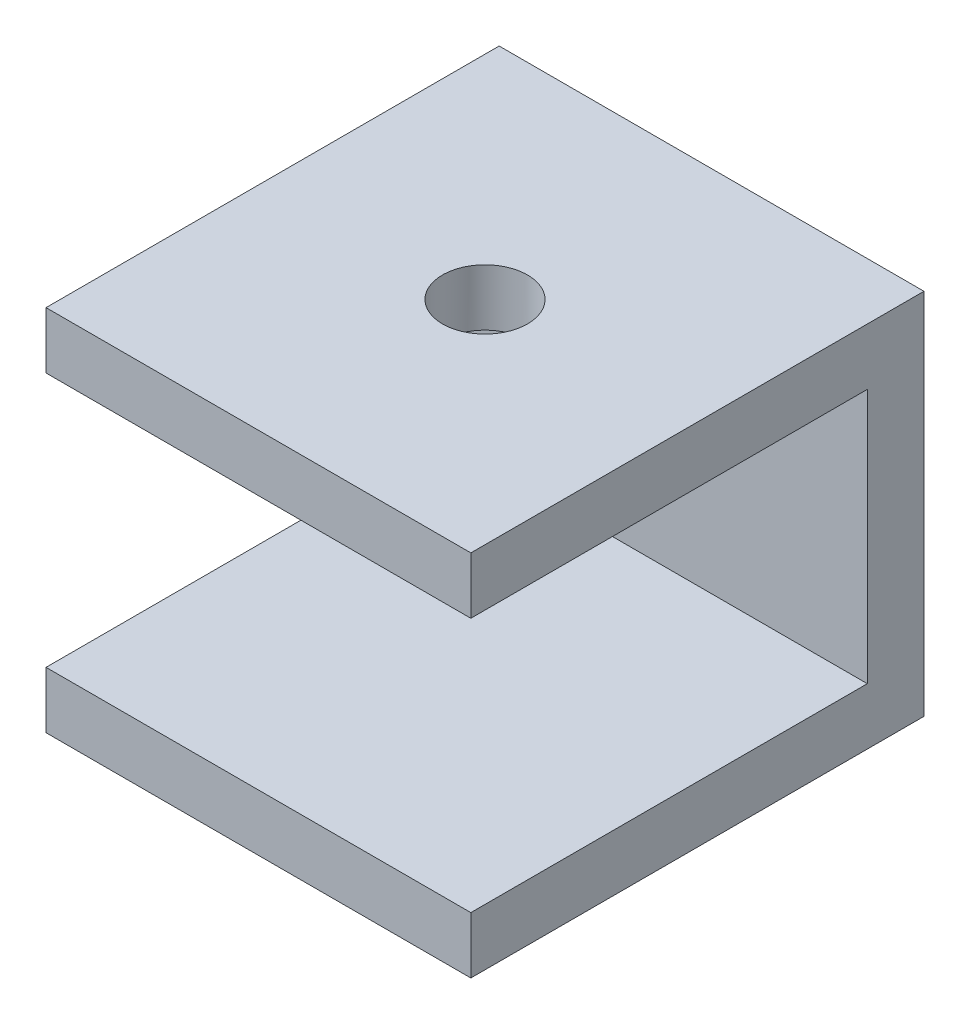
ISO-10303-21;
HEADER;
FILE_DESCRIPTION(('STEP AP214'),'2;1');
FILE_NAME('part.step','',(''),(''),'','','');
FILE_SCHEMA(('AUTOMOTIVE_DESIGN { 1 0 10303 214 1 1 1 1 }'));
ENDSEC;
DATA;
#1=APPLICATION_CONTEXT('core data for automotive mechanical design processes');
#2=APPLICATION_PROTOCOL_DEFINITION('international standard','automotive_design',2000,#1);
#3=PRODUCT_CONTEXT('',#1,'mechanical');
#4=PRODUCT('Part','Part','',(#3));
#5=PRODUCT_RELATED_PRODUCT_CATEGORY('part','',(#4));
#6=PRODUCT_DEFINITION_FORMATION('','',#4);
#7=PRODUCT_DEFINITION_CONTEXT('part definition',#1,'design');
#8=PRODUCT_DEFINITION('design','',#6,#7);
#9=PRODUCT_DEFINITION_SHAPE('','',#8);
#10=(LENGTH_UNIT() NAMED_UNIT(*) SI_UNIT(.MILLI.,.METRE.));
#11=(NAMED_UNIT(*) PLANE_ANGLE_UNIT() SI_UNIT($,.RADIAN.));
#12=(NAMED_UNIT(*) SI_UNIT($,.STERADIAN.) SOLID_ANGLE_UNIT());
#13=UNCERTAINTY_MEASURE_WITH_UNIT(LENGTH_MEASURE(1.E-05),#10,'distance_accuracy_value','');
#14=(GEOMETRIC_REPRESENTATION_CONTEXT(3) GLOBAL_UNCERTAINTY_ASSIGNED_CONTEXT((#13)) GLOBAL_UNIT_ASSIGNED_CONTEXT((#10,
#11,#12)) REPRESENTATION_CONTEXT('',''));
#15=CARTESIAN_POINT('',(0.,0.,0.));
#16=DIRECTION('',(0.,0.,1.));
#17=DIRECTION('',(1.,0.,0.));
#18=AXIS2_PLACEMENT_3D('',#15,#16,#17);
#19=CARTESIAN_POINT('',(-15.,0.,16.));
#20=DIRECTION('',(0.,1.,0.));
#21=DIRECTION('',(0.,0.,1.));
#22=AXIS2_PLACEMENT_3D('',#19,#20,#21);
#23=PLANE('',#22);
#24=CARTESIAN_POINT('',(-7.5,0.,8.));
#25=DIRECTION('',(0.,1.,0.));
#26=DIRECTION('',(0.,0.,1.));
#27=AXIS2_PLACEMENT_3D('',#24,#25,#26);
#28=CIRCLE('',#27,1.5);
#29=CARTESIAN_POINT('',(-7.5,0.,9.5));
#30=VERTEX_POINT('',#29);
#31=EDGE_CURVE('E133',#30,#30,#28,.T.);
#32=ORIENTED_EDGE('',*,*,#31,.F.);
#33=EDGE_LOOP('',(#32));
#34=FACE_BOUND('',#33,.T.);
#35=DIRECTION('',(0.,0.,1.));
#36=VECTOR('',#35,1.);
#37=CARTESIAN_POINT('',(0.,0.,16.));
#38=LINE('',#37,#36);
#39=CARTESIAN_POINT('',(0.,0.,0.));
#40=VERTEX_POINT('',#39);
#41=CARTESIAN_POINT('',(0.,0.,16.));
#42=VERTEX_POINT('',#41);
#43=EDGE_CURVE('E129',#40,#42,#38,.T.);
#44=ORIENTED_EDGE('',*,*,#43,.F.);
#45=DIRECTION('',(1.,0.,0.));
#46=VECTOR('',#45,1.);
#47=CARTESIAN_POINT('',(-15.,0.,0.));
#48=LINE('',#47,#46);
#49=CARTESIAN_POINT('',(-15.,0.,0.));
#50=VERTEX_POINT('',#49);
#51=EDGE_CURVE('E11',#50,#40,#48,.T.);
#52=ORIENTED_EDGE('',*,*,#51,.F.);
#53=DIRECTION('',(0.,0.,1.));
#54=VECTOR('',#53,1.);
#55=CARTESIAN_POINT('',(-15.,0.,16.));
#56=LINE('',#55,#54);
#57=CARTESIAN_POINT('',(-15.,0.,16.));
#58=VERTEX_POINT('',#57);
#59=EDGE_CURVE('E150',#50,#58,#56,.T.);
#60=ORIENTED_EDGE('',*,*,#59,.T.);
#61=DIRECTION('',(1.,0.,0.));
#62=VECTOR('',#61,1.);
#63=CARTESIAN_POINT('',(-15.,0.,16.));
#64=LINE('',#63,#62);
#65=EDGE_CURVE('E35',#58,#42,#64,.T.);
#66=ORIENTED_EDGE('',*,*,#65,.T.);
#67=EDGE_LOOP('',(#44,#52,#60,#66));
#68=FACE_BOUND('',#67,.T.);
#69=ADVANCED_FACE('F32',(#34,#68),#23,.T.);
#70=CARTESIAN_POINT('',(-15.,0.,0.));
#71=DIRECTION('',(0.,0.,-1.));
#72=DIRECTION('',(0.,1.,0.));
#73=AXIS2_PLACEMENT_3D('',#70,#71,#72);
#74=PLANE('',#73);
#75=DIRECTION('',(0.,1.,0.));
#76=VECTOR('',#75,1.);
#77=CARTESIAN_POINT('',(0.,0.,0.));
#78=LINE('',#77,#76);
#79=CARTESIAN_POINT('',(0.,-13.,0.));
#80=VERTEX_POINT('',#79);
#81=EDGE_CURVE('E148',#80,#40,#78,.T.);
#82=ORIENTED_EDGE('',*,*,#81,.F.);
#83=DIRECTION('',(1.,0.,0.));
#84=VECTOR('',#83,1.);
#85=CARTESIAN_POINT('',(-15.,-13.,0.));
#86=LINE('',#85,#84);
#87=CARTESIAN_POINT('',(-15.,-13.,0.));
#88=VERTEX_POINT('',#87);
#89=EDGE_CURVE('E41',#88,#80,#86,.T.);
#90=ORIENTED_EDGE('',*,*,#89,.F.);
#91=DIRECTION('',(0.,1.,0.));
#92=VECTOR('',#91,1.);
#93=CARTESIAN_POINT('',(-15.,0.,0.));
#94=LINE('',#93,#92);
#95=EDGE_CURVE('E119',#88,#50,#94,.T.);
#96=ORIENTED_EDGE('',*,*,#95,.T.);
#97=ORIENTED_EDGE('',*,*,#51,.T.);
#98=EDGE_LOOP('',(#82,#90,#96,#97));
#99=FACE_BOUND('',#98,.T.);
#100=ADVANCED_FACE('F162',(#99),#74,.T.);
#101=CARTESIAN_POINT('',(-15.,-13.,0.));
#102=DIRECTION('',(0.,-1.,0.));
#103=DIRECTION('',(0.,0.,-1.));
#104=AXIS2_PLACEMENT_3D('',#101,#102,#103);
#105=PLANE('',#104);
#106=DIRECTION('',(0.,0.,-1.));
#107=VECTOR('',#106,1.);
#108=CARTESIAN_POINT('',(0.,-13.,0.));
#109=LINE('',#108,#107);
#110=CARTESIAN_POINT('',(0.,-13.,16.));
#111=VERTEX_POINT('',#110);
#112=EDGE_CURVE('E106',#111,#80,#109,.T.);
#113=ORIENTED_EDGE('',*,*,#112,.F.);
#114=DIRECTION('',(1.,0.,0.));
#115=VECTOR('',#114,1.);
#116=CARTESIAN_POINT('',(-15.,-13.,16.));
#117=LINE('',#116,#115);
#118=CARTESIAN_POINT('',(-15.,-13.,16.));
#119=VERTEX_POINT('',#118);
#120=EDGE_CURVE('E101',#119,#111,#117,.T.);
#121=ORIENTED_EDGE('',*,*,#120,.F.);
#122=DIRECTION('',(0.,0.,-1.));
#123=VECTOR('',#122,1.);
#124=CARTESIAN_POINT('',(-15.,-13.,0.));
#125=LINE('',#124,#123);
#126=EDGE_CURVE('E104',#119,#88,#125,.T.);
#127=ORIENTED_EDGE('',*,*,#126,.T.);
#128=ORIENTED_EDGE('',*,*,#89,.T.);
#129=EDGE_LOOP('',(#113,#121,#127,#128));
#130=FACE_BOUND('',#129,.T.);
#131=ADVANCED_FACE('F103',(#130),#105,.T.);
#132=CARTESIAN_POINT('',(-15.,-13.,16.));
#133=DIRECTION('',(0.,0.,1.));
#134=DIRECTION('',(0.,-1.,0.));
#135=AXIS2_PLACEMENT_3D('',#132,#133,#134);
#136=PLANE('',#135);
#137=DIRECTION('',(0.,-1.,0.));
#138=VECTOR('',#137,1.);
#139=CARTESIAN_POINT('',(0.,-13.,16.));
#140=LINE('',#139,#138);
#141=CARTESIAN_POINT('',(0.,-11.,16.));
#142=VERTEX_POINT('',#141);
#143=EDGE_CURVE('E145',#142,#111,#140,.T.);
#144=ORIENTED_EDGE('',*,*,#143,.F.);
#145=DIRECTION('',(1.,0.,0.));
#146=VECTOR('',#145,1.);
#147=CARTESIAN_POINT('',(-15.,-11.,16.));
#148=LINE('',#147,#146);
#149=CARTESIAN_POINT('',(-15.,-11.,16.));
#150=VERTEX_POINT('',#149);
#151=EDGE_CURVE('E111',#150,#142,#148,.T.);
#152=ORIENTED_EDGE('',*,*,#151,.F.);
#153=DIRECTION('',(0.,-1.,0.));
#154=VECTOR('',#153,1.);
#155=CARTESIAN_POINT('',(-15.,-13.,16.));
#156=LINE('',#155,#154);
#157=EDGE_CURVE('E117',#150,#119,#156,.T.);
#158=ORIENTED_EDGE('',*,*,#157,.T.);
#159=ORIENTED_EDGE('',*,*,#120,.T.);
#160=EDGE_LOOP('',(#144,#152,#158,#159));
#161=FACE_BOUND('',#160,.T.);
#162=ADVANCED_FACE('F121',(#161),#136,.T.);
#163=CARTESIAN_POINT('',(-15.,-11.,16.));
#164=DIRECTION('',(0.,1.,0.));
#165=DIRECTION('',(0.,0.,1.));
#166=AXIS2_PLACEMENT_3D('',#163,#164,#165);
#167=PLANE('',#166);
#168=DIRECTION('',(0.,0.,1.));
#169=VECTOR('',#168,1.);
#170=CARTESIAN_POINT('',(0.,-11.,16.));
#171=LINE('',#170,#169);
#172=CARTESIAN_POINT('',(0.,-11.,2.));
#173=VERTEX_POINT('',#172);
#174=EDGE_CURVE('E142',#173,#142,#171,.T.);
#175=ORIENTED_EDGE('',*,*,#174,.F.);
#176=DIRECTION('',(1.,0.,0.));
#177=VECTOR('',#176,1.);
#178=CARTESIAN_POINT('',(-15.,-11.,2.));
#179=LINE('',#178,#177);
#180=CARTESIAN_POINT('',(-15.,-11.,2.));
#181=VERTEX_POINT('',#180);
#182=EDGE_CURVE('E154',#181,#173,#179,.T.);
#183=ORIENTED_EDGE('',*,*,#182,.F.);
#184=DIRECTION('',(0.,0.,1.));
#185=VECTOR('',#184,1.);
#186=CARTESIAN_POINT('',(-15.,-11.,16.));
#187=LINE('',#186,#185);
#188=EDGE_CURVE('E122',#181,#150,#187,.T.);
#189=ORIENTED_EDGE('',*,*,#188,.T.);
#190=ORIENTED_EDGE('',*,*,#151,.T.);
#191=EDGE_LOOP('',(#175,#183,#189,#190));
#192=FACE_BOUND('',#191,.T.);
#193=ADVANCED_FACE('F176',(#192),#167,.T.);
#194=CARTESIAN_POINT('',(-15.,-11.,2.));
#195=DIRECTION('',(0.,0.,1.));
#196=DIRECTION('',(0.,-1.,0.));
#197=AXIS2_PLACEMENT_3D('',#194,#195,#196);
#198=PLANE('',#197);
#199=DIRECTION('',(0.,-1.,0.));
#200=VECTOR('',#199,1.);
#201=CARTESIAN_POINT('',(0.,-11.,2.));
#202=LINE('',#201,#200);
#203=CARTESIAN_POINT('',(0.,-2.,2.));
#204=VERTEX_POINT('',#203);
#205=EDGE_CURVE('E139',#204,#173,#202,.T.);
#206=ORIENTED_EDGE('',*,*,#205,.F.);
#207=DIRECTION('',(1.,0.,0.));
#208=VECTOR('',#207,1.);
#209=CARTESIAN_POINT('',(-15.,-2.,2.));
#210=LINE('',#209,#208);
#211=CARTESIAN_POINT('',(-15.,-2.,2.));
#212=VERTEX_POINT('',#211);
#213=EDGE_CURVE('E156',#212,#204,#210,.T.);
#214=ORIENTED_EDGE('',*,*,#213,.F.);
#215=DIRECTION('',(0.,-1.,0.));
#216=VECTOR('',#215,1.);
#217=CARTESIAN_POINT('',(-15.,-11.,2.));
#218=LINE('',#217,#216);
#219=EDGE_CURVE('E124',#212,#181,#218,.T.);
#220=ORIENTED_EDGE('',*,*,#219,.T.);
#221=ORIENTED_EDGE('',*,*,#182,.T.);
#222=EDGE_LOOP('',(#206,#214,#220,#221));
#223=FACE_BOUND('',#222,.T.);
#224=ADVANCED_FACE('F179',(#223),#198,.T.);
#225=CARTESIAN_POINT('',(-15.,-2.,2.));
#226=DIRECTION('',(0.,-1.,0.));
#227=DIRECTION('',(0.,0.,-1.));
#228=AXIS2_PLACEMENT_3D('',#225,#226,#227);
#229=PLANE('',#228);
#230=CARTESIAN_POINT('',(-7.5,-2.,8.));
#231=DIRECTION('',(0.,-1.,0.));
#232=DIRECTION('',(0.,0.,-1.));
#233=AXIS2_PLACEMENT_3D('',#230,#231,#232);
#234=CIRCLE('',#233,1.5);
#235=CARTESIAN_POINT('',(-7.5,-2.,6.5));
#236=VERTEX_POINT('',#235);
#237=EDGE_CURVE('E203',#236,#236,#234,.F.);
#238=ORIENTED_EDGE('',*,*,#237,.T.);
#239=EDGE_LOOP('',(#238));
#240=FACE_BOUND('',#239,.T.);
#241=DIRECTION('',(0.,0.,-1.));
#242=VECTOR('',#241,1.);
#243=CARTESIAN_POINT('',(0.,-2.,2.));
#244=LINE('',#243,#242);
#245=CARTESIAN_POINT('',(0.,-2.,16.));
#246=VERTEX_POINT('',#245);
#247=EDGE_CURVE('E136',#246,#204,#244,.T.);
#248=ORIENTED_EDGE('',*,*,#247,.F.);
#249=DIRECTION('',(1.,0.,0.));
#250=VECTOR('',#249,1.);
#251=CARTESIAN_POINT('',(-15.,-2.,16.));
#252=LINE('',#251,#250);
#253=CARTESIAN_POINT('',(-15.,-2.,16.));
#254=VERTEX_POINT('',#253);
#255=EDGE_CURVE('E157',#254,#246,#252,.T.);
#256=ORIENTED_EDGE('',*,*,#255,.F.);
#257=DIRECTION('',(0.,0.,-1.));
#258=VECTOR('',#257,1.);
#259=CARTESIAN_POINT('',(-15.,-2.,2.));
#260=LINE('',#259,#258);
#261=EDGE_CURVE('E212',#254,#212,#260,.T.);
#262=ORIENTED_EDGE('',*,*,#261,.T.);
#263=ORIENTED_EDGE('',*,*,#213,.T.);
#264=EDGE_LOOP('',(#248,#256,#262,#263));
#265=FACE_BOUND('',#264,.T.);
#266=ADVANCED_FACE('F183',(#240,#265),#229,.T.);
#267=CARTESIAN_POINT('',(-15.,-2.,16.));
#268=DIRECTION('',(0.,0.,1.));
#269=DIRECTION('',(1.,0.,0.));
#270=AXIS2_PLACEMENT_3D('',#267,#268,#269);
#271=PLANE('',#270);
#272=DIRECTION('',(0.,-1.,0.));
#273=VECTOR('',#272,1.);
#274=CARTESIAN_POINT('',(0.,-2.,16.));
#275=LINE('',#274,#273);
#276=EDGE_CURVE('E132',#42,#246,#275,.T.);
#277=ORIENTED_EDGE('',*,*,#276,.F.);
#278=ORIENTED_EDGE('',*,*,#65,.F.);
#279=DIRECTION('',(0.,-1.,0.));
#280=VECTOR('',#279,1.);
#281=CARTESIAN_POINT('',(-15.,-2.,16.));
#282=LINE('',#281,#280);
#283=EDGE_CURVE('E210',#58,#254,#282,.T.);
#284=ORIENTED_EDGE('',*,*,#283,.T.);
#285=ORIENTED_EDGE('',*,*,#255,.T.);
#286=EDGE_LOOP('',(#277,#278,#284,#285));
#287=FACE_BOUND('',#286,.T.);
#288=ADVANCED_FACE('F159',(#287),#271,.T.);
#289=CARTESIAN_POINT('',(-15.,0.,0.));
#290=DIRECTION('',(-1.,0.,0.));
#291=DIRECTION('',(0.,0.,1.));
#292=AXIS2_PLACEMENT_3D('',#289,#290,#291);
#293=PLANE('',#292);
#294=ORIENTED_EDGE('',*,*,#59,.F.);
#295=ORIENTED_EDGE('',*,*,#95,.F.);
#296=ORIENTED_EDGE('',*,*,#126,.F.);
#297=ORIENTED_EDGE('',*,*,#157,.F.);
#298=ORIENTED_EDGE('',*,*,#188,.F.);
#299=ORIENTED_EDGE('',*,*,#219,.F.);
#300=ORIENTED_EDGE('',*,*,#261,.F.);
#301=ORIENTED_EDGE('',*,*,#283,.F.);
#302=EDGE_LOOP('',(#294,#295,#296,#297,#298,#299,#300,#301));
#303=FACE_BOUND('',#302,.T.);
#304=ADVANCED_FACE('F115',(#303),#293,.T.);
#305=CARTESIAN_POINT('',(0.,0.,0.));
#306=DIRECTION('',(-1.,0.,0.));
#307=DIRECTION('',(0.,0.,1.));
#308=AXIS2_PLACEMENT_3D('',#305,#306,#307);
#309=PLANE('',#308);
#310=ORIENTED_EDGE('',*,*,#43,.T.);
#311=ORIENTED_EDGE('',*,*,#276,.T.);
#312=ORIENTED_EDGE('',*,*,#247,.T.);
#313=ORIENTED_EDGE('',*,*,#205,.T.);
#314=ORIENTED_EDGE('',*,*,#174,.T.);
#315=ORIENTED_EDGE('',*,*,#143,.T.);
#316=ORIENTED_EDGE('',*,*,#112,.T.);
#317=ORIENTED_EDGE('',*,*,#81,.T.);
#318=EDGE_LOOP('',(#310,#311,#312,#313,#314,#315,#316,#317));
#319=FACE_BOUND('',#318,.T.);
#320=ADVANCED_FACE('F161',(#319),#309,.F.);
#321=CARTESIAN_POINT('',(-7.5,-13.001,8.));
#322=DIRECTION('',(0.,1.,0.));
#323=DIRECTION('',(0.,0.,1.));
#324=AXIS2_PLACEMENT_3D('',#321,#322,#323);
#325=CYLINDRICAL_SURFACE('',#324,1.5);
#326=ORIENTED_EDGE('',*,*,#237,.F.);
#327=EDGE_LOOP('',(#326));
#328=FACE_BOUND('',#327,.T.);
#329=ORIENTED_EDGE('',*,*,#31,.T.);
#330=EDGE_LOOP('',(#329));
#331=FACE_BOUND('',#330,.T.);
#332=ADVANCED_FACE('F194',(#328,#331),#325,.F.);
#333=CLOSED_SHELL('',(#69,#100,#131,#162,#193,#224,#266,#288,#304,#320,#332));
#334=MANIFOLD_SOLID_BREP('B2',#333);
#335=ADVANCED_BREP_SHAPE_REPRESENTATION('',(#18,#334),#14);
#336=SHAPE_DEFINITION_REPRESENTATION(#9,#335);
ENDSEC;
END-ISO-10303-21;
